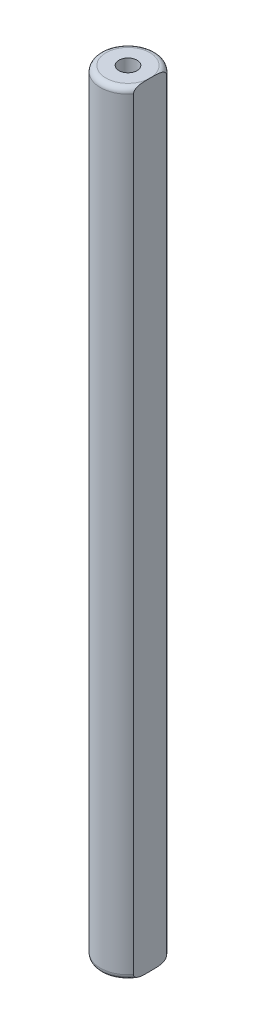
ISO-10303-21;
HEADER;
FILE_DESCRIPTION(('STEP AP214'),'2;1');
FILE_NAME('part.step','',(''),(''),'','','');
FILE_SCHEMA(('AUTOMOTIVE_DESIGN { 1 0 10303 214 1 1 1 1 }'));
ENDSEC;
DATA;
#1=APPLICATION_CONTEXT('core data for automotive mechanical design processes');
#2=APPLICATION_PROTOCOL_DEFINITION('international standard','automotive_design',2000,#1);
#3=PRODUCT_CONTEXT('',#1,'mechanical');
#4=PRODUCT('Part','Part','',(#3));
#5=PRODUCT_RELATED_PRODUCT_CATEGORY('part','',(#4));
#6=PRODUCT_DEFINITION_FORMATION('','',#4);
#7=PRODUCT_DEFINITION_CONTEXT('part definition',#1,'design');
#8=PRODUCT_DEFINITION('design','',#6,#7);
#9=PRODUCT_DEFINITION_SHAPE('','',#8);
#10=(LENGTH_UNIT() NAMED_UNIT(*) SI_UNIT(.MILLI.,.METRE.));
#11=(NAMED_UNIT(*) PLANE_ANGLE_UNIT() SI_UNIT($,.RADIAN.));
#12=(NAMED_UNIT(*) SI_UNIT($,.STERADIAN.) SOLID_ANGLE_UNIT());
#13=UNCERTAINTY_MEASURE_WITH_UNIT(LENGTH_MEASURE(1.E-05),#10,'distance_accuracy_value','');
#14=(GEOMETRIC_REPRESENTATION_CONTEXT(3) GLOBAL_UNCERTAINTY_ASSIGNED_CONTEXT((#13)) GLOBAL_UNIT_ASSIGNED_CONTEXT((#10,
#11,#12)) REPRESENTATION_CONTEXT('',''));
#15=CARTESIAN_POINT('',(0.,0.,0.));
#16=DIRECTION('',(0.,0.,1.));
#17=DIRECTION('',(1.,0.,0.));
#18=AXIS2_PLACEMENT_3D('',#15,#16,#17);
#19=CARTESIAN_POINT('',(0.,-35.15,0.));
#20=DIRECTION('',(0.,-1.,0.));
#21=DIRECTION('',(0.,0.,1.));
#22=AXIS2_PLACEMENT_3D('',#19,#20,#21);
#23=PLANE('',#22);
#24=CARTESIAN_POINT('',(0.,-35.15,0.));
#25=DIRECTION('',(0.,-1.,0.));
#26=DIRECTION('',(0.,0.,-1.));
#27=AXIS2_PLACEMENT_3D('',#24,#25,#26);
#28=CIRCLE('',#27,2.);
#29=CARTESIAN_POINT('',(2.,-35.15,0.));
#30=VERTEX_POINT('',#29);
#31=EDGE_CURVE('E11',#30,#30,#28,.T.);
#32=ORIENTED_EDGE('',*,*,#31,.T.);
#33=EDGE_LOOP('',(#32));
#34=FACE_BOUND('',#33,.T.);
#35=CARTESIAN_POINT('',(0.,-35.15,0.));
#36=DIRECTION('',(0.,1.,0.));
#37=DIRECTION('',(0.,0.,1.));
#38=AXIS2_PLACEMENT_3D('',#35,#36,#37);
#39=CIRCLE('',#38,0.825);
#40=CARTESIAN_POINT('',(0.,-35.15,0.825));
#41=VERTEX_POINT('',#40);
#42=EDGE_CURVE('E136',#41,#41,#39,.T.);
#43=ORIENTED_EDGE('',*,*,#42,.T.);
#44=EDGE_LOOP('',(#43));
#45=FACE_BOUND('',#44,.T.);
#46=ADVANCED_FACE('F32',(#34,#45),#23,.T.);
#47=CARTESIAN_POINT('',(0.,35.15,0.));
#48=DIRECTION('',(0.,-1.,0.));
#49=DIRECTION('',(0.,0.,-1.));
#50=AXIS2_PLACEMENT_3D('',#47,#48,#49);
#51=CYLINDRICAL_SURFACE('',#50,2.5);
#52=DIRECTION('',(0.,1.,0.));
#53=VECTOR('',#52,1.);
#54=CARTESIAN_POINT('',(2.,0.,-1.5));
#55=LINE('',#54,#53);
#56=CARTESIAN_POINT('',(2.,-34.65,-1.5));
#57=VERTEX_POINT('',#56);
#58=CARTESIAN_POINT('',(2.,34.65,-1.5));
#59=VERTEX_POINT('',#58);
#60=EDGE_CURVE('E79',#57,#59,#55,.T.);
#61=ORIENTED_EDGE('',*,*,#60,.F.);
#62=CARTESIAN_POINT('',(0.,-34.65,0.));
#63=DIRECTION('',(0.,-1.,0.));
#64=DIRECTION('',(0.,0.,-1.));
#65=AXIS2_PLACEMENT_3D('',#62,#63,#64);
#66=CIRCLE('',#65,2.5);
#67=CARTESIAN_POINT('',(2.,-34.65,1.5));
#68=VERTEX_POINT('',#67);
#69=EDGE_CURVE('E118',#57,#68,#66,.F.);
#70=ORIENTED_EDGE('',*,*,#69,.T.);
#71=DIRECTION('',(0.,1.,0.));
#72=VECTOR('',#71,1.);
#73=CARTESIAN_POINT('',(2.,0.,1.5));
#74=LINE('',#73,#72);
#75=CARTESIAN_POINT('',(2.,34.65,1.5));
#76=VERTEX_POINT('',#75);
#77=EDGE_CURVE('E124',#68,#76,#74,.T.);
#78=ORIENTED_EDGE('',*,*,#77,.T.);
#79=CARTESIAN_POINT('',(0.,34.65,0.));
#80=DIRECTION('',(0.,1.,0.));
#81=DIRECTION('',(0.,0.,1.));
#82=AXIS2_PLACEMENT_3D('',#79,#80,#81);
#83=CIRCLE('',#82,2.5);
#84=EDGE_CURVE('E74',#76,#59,#83,.F.);
#85=ORIENTED_EDGE('',*,*,#84,.T.);
#86=EDGE_LOOP('',(#61,#70,#78,#85));
#87=FACE_BOUND('',#86,.T.);
#88=ADVANCED_FACE('F155',(#87),#51,.T.);
#89=CARTESIAN_POINT('',(0.,35.15,0.));
#90=DIRECTION('',(0.,1.,0.));
#91=DIRECTION('',(0.,0.,1.));
#92=AXIS2_PLACEMENT_3D('',#89,#90,#91);
#93=PLANE('',#92);
#94=CARTESIAN_POINT('',(0.,35.15,0.));
#95=DIRECTION('',(0.,1.,0.));
#96=DIRECTION('',(0.,0.,1.));
#97=AXIS2_PLACEMENT_3D('',#94,#95,#96);
#98=CIRCLE('',#97,2.);
#99=CARTESIAN_POINT('',(2.,35.15,0.));
#100=VERTEX_POINT('',#99);
#101=EDGE_CURVE('E72',#100,#100,#98,.T.);
#102=ORIENTED_EDGE('',*,*,#101,.T.);
#103=EDGE_LOOP('',(#102));
#104=FACE_BOUND('',#103,.T.);
#105=CARTESIAN_POINT('',(0.,35.15,0.));
#106=DIRECTION('',(0.,1.,0.));
#107=DIRECTION('',(0.,0.,1.));
#108=AXIS2_PLACEMENT_3D('',#105,#106,#107);
#109=CIRCLE('',#108,0.825);
#110=CARTESIAN_POINT('',(0.,35.15,0.825));
#111=VERTEX_POINT('',#110);
#112=EDGE_CURVE('E87',#111,#111,#109,.T.);
#113=ORIENTED_EDGE('',*,*,#112,.F.);
#114=EDGE_LOOP('',(#113));
#115=FACE_BOUND('',#114,.T.);
#116=ADVANCED_FACE('F82',(#104,#115),#93,.T.);
#117=CARTESIAN_POINT('',(0.,30.15,0.));
#118=DIRECTION('',(0.,1.,0.));
#119=DIRECTION('',(0.,0.,1.));
#120=AXIS2_PLACEMENT_3D('',#117,#118,#119);
#121=CYLINDRICAL_SURFACE('',#120,0.825);
#122=CARTESIAN_POINT('',(0.,30.15,0.));
#123=DIRECTION('',(0.,1.,0.));
#124=DIRECTION('',(0.,0.,1.));
#125=AXIS2_PLACEMENT_3D('',#122,#123,#124);
#126=CIRCLE('',#125,0.825);
#127=CARTESIAN_POINT('',(0.,30.15,0.825));
#128=VERTEX_POINT('',#127);
#129=EDGE_CURVE('E84',#128,#128,#126,.T.);
#130=ORIENTED_EDGE('',*,*,#129,.F.);
#131=EDGE_LOOP('',(#130));
#132=FACE_BOUND('',#131,.T.);
#133=ORIENTED_EDGE('',*,*,#112,.T.);
#134=EDGE_LOOP('',(#133));
#135=FACE_BOUND('',#134,.T.);
#136=ADVANCED_FACE('F162',(#132,#135),#121,.F.);
#137=CARTESIAN_POINT('',(0.,30.15,0.));
#138=DIRECTION('',(0.,1.,0.));
#139=DIRECTION('',(0.,0.,1.));
#140=AXIS2_PLACEMENT_3D('',#137,#138,#139);
#141=PLANE('',#140);
#142=ORIENTED_EDGE('',*,*,#129,.T.);
#143=EDGE_LOOP('',(#142));
#144=FACE_BOUND('',#143,.T.);
#145=ADVANCED_FACE('F106',(#144),#141,.T.);
#146=CARTESIAN_POINT('',(2.,0.,-1.5));
#147=DIRECTION('',(-1.,0.,0.));
#148=DIRECTION('',(0.,0.,1.));
#149=AXIS2_PLACEMENT_3D('',#146,#147,#148);
#150=PLANE('',#149);
#151=ORIENTED_EDGE('',*,*,#77,.F.);
#152=CARTESIAN_POINT('',(2.,-34.65,1.5));
#153=CARTESIAN_POINT('',(2.,-34.6700065150284,1.50005508764519));
#154=CARTESIAN_POINT('',(2.,-34.6899505223803,1.49800297503596));
#155=CARTESIAN_POINT('',(2.,-34.7288908622129,1.49017103135305));
#156=CARTESIAN_POINT('',(2.,-34.747894786355,1.48442943896433));
#157=CARTESIAN_POINT('',(2.,-34.7845007170815,1.46971395516311));
#158=CARTESIAN_POINT('',(2.,-34.8021074472319,1.46075157527048));
#159=CARTESIAN_POINT('',(2.,-34.8357418270519,1.44018960181346));
#160=CARTESIAN_POINT('',(2.,-34.8517650844176,1.42858295243752));
#161=CARTESIAN_POINT('',(2.,-34.8889337995344,1.39760924057378));
#162=CARTESIAN_POINT('',(2.,-34.9091275913188,1.37710380043444));
#163=CARTESIAN_POINT('',(2.,-34.9460193785026,1.3332153788633));
#164=CARTESIAN_POINT('',(2.,-34.9627135559447,1.30982929844171));
#165=CARTESIAN_POINT('',(2.,-35.0025266059827,1.24588475655888));
#166=CARTESIAN_POINT('',(2.,-35.0231102761167,1.20375339504331));
#167=CARTESIAN_POINT('',(2.,-35.0492657628372,1.13857481760512));
#168=CARTESIAN_POINT('',(2.,-35.0572271665565,1.11639476146754));
#169=CARTESIAN_POINT('',(2.,-35.0717347834849,1.07158652733004));
#170=CARTESIAN_POINT('',(2.,-35.0782820228324,1.04895868735181));
#171=CARTESIAN_POINT('',(2.,-35.0954775535542,0.982989447767375));
#172=CARTESIAN_POINT('',(2.,-35.1045494991958,0.939240813702868));
#173=CARTESIAN_POINT('',(2.,-35.1194389319571,0.85118057519475));
#174=CARTESIAN_POINT('',(2.,-35.1252529100803,0.806868416119317));
#175=CARTESIAN_POINT('',(2.,-35.1345404183726,0.717748873858497));
#176=CARTESIAN_POINT('',(2.,-35.1380000262617,0.672940110398228));
#177=CARTESIAN_POINT('',(2.,-35.143276064899,0.583224127429996));
#178=CARTESIAN_POINT('',(2.,-35.1450920982067,0.53831688673903));
#179=CARTESIAN_POINT('',(2.,-35.1475884411658,0.45202717013826));
#180=CARTESIAN_POINT('',(2.,-35.148347176557,0.410646661478023));
#181=CARTESIAN_POINT('',(2.,-35.1493649293624,0.327877214900453));
#182=CARTESIAN_POINT('',(2.,-35.1496239046375,0.286488276566584));
#183=CARTESIAN_POINT('',(2.,-35.1499262759538,0.204245986253958));
#184=CARTESIAN_POINT('',(2.,-35.1499724201265,0.163392638975686));
#185=CARTESIAN_POINT('',(2.,-35.1499994454164,0.0816928216893292));
#186=CARTESIAN_POINT('',(2.,-35.1499803376138,0.0408463516913637));
#187=CARTESIAN_POINT('',(2.,-35.15,0.));
#188=B_SPLINE_CURVE_WITH_KNOTS('',3,(#152,#153,#154,#155,#156,#157,#158,#159,#160,#161,#162,
#163,#164,#165,#166,#167,#168,#169,#170,#171,#172,#173,#174,#175,#176,#177,#178,#179,#180,#181,
#182,#183,#184,#185,#186,#187),.UNSPECIFIED.,.F.,.F.,(4,2,2,2,2,2,2,2,2,2,2,2,2,2,2,2,2,4),(0.,
0.0598154823382477,0.119020807803606,0.178016596524454,0.237171689151979,0.323022405322567,
0.408966299732605,0.548800102010772,0.619474466309537,0.690097374684527,0.823948961414437,
0.957944437366601,1.09272554990601,1.22753924580541,1.35169671337948,1.47586464927862,
1.59842472260636,1.72096398530663),.UNSPECIFIED.);
#189=EDGE_CURVE('E41',#68,#30,#188,.T.);
#190=ORIENTED_EDGE('',*,*,#189,.T.);
#191=CARTESIAN_POINT('',(2.,-35.15,0.));
#192=CARTESIAN_POINT('',(2.,-35.149980484284,-0.0407626231076289));
#193=CARTESIAN_POINT('',(2.,-35.1499994433899,-0.0815253750922564));
#194=CARTESIAN_POINT('',(2.,-35.1499726519699,-0.163057529759021));
#195=CARTESIAN_POINT('',(2.,-35.1499268907924,-0.203826932431489));
#196=CARTESIAN_POINT('',(2.,-35.1496272394696,-0.285823216792328));
#197=CARTESIAN_POINT('',(2.,-35.1493710177251,-0.327050094241002));
#198=CARTESIAN_POINT('',(2.,-35.1483653267444,-0.409495794992682));
#199=CARTESIAN_POINT('',(2.,-35.1476158970779,-0.450714618676486));
#200=CARTESIAN_POINT('',(2.,-35.1452076449429,-0.534687159846425));
#201=CARTESIAN_POINT('',(2.,-35.1435155371863,-0.577440036322863));
#202=CARTESIAN_POINT('',(2.,-35.1386762279352,-0.662861842446352));
#203=CARTESIAN_POINT('',(2.,-35.1355293281928,-0.705530787660099));
#204=CARTESIAN_POINT('',(2.,-35.1271629448661,-0.790467964812873));
#205=CARTESIAN_POINT('',(2.,-35.1219534285849,-0.832737137282493));
#206=CARTESIAN_POINT('',(2.,-35.1087065375739,-0.916821134882455));
#207=CARTESIAN_POINT('',(2.,-35.1006717348777,-0.958636337716518));
#208=CARTESIAN_POINT('',(2.,-35.0868499282799,-1.01633423815903));
#209=CARTESIAN_POINT('',(2.,-35.0826447414506,-1.0325980627166));
#210=CARTESIAN_POINT('',(2.,-35.0735803939948,-1.06494846149724));
#211=CARTESIAN_POINT('',(2.,-35.0687209867408,-1.08103496638818));
#212=CARTESIAN_POINT('',(2.,-35.0530766101654,-1.12889043811801));
#213=CARTESIAN_POINT('',(2.,-35.0412104355907,-1.16032087149606));
#214=CARTESIAN_POINT('',(2.,-35.0138471087185,-1.22193787642586));
#215=CARTESIAN_POINT('',(2.,-34.9983172442343,-1.25211017751241));
#216=CARTESIAN_POINT('',(2.,-34.9629711649222,-1.30987180248264));
#217=CARTESIAN_POINT('',(2.,-34.9431618343013,-1.33746517402654));
#218=CARTESIAN_POINT('',(2.,-34.9063229296638,-1.37963467843693));
#219=CARTESIAN_POINT('',(2.,-34.890685118637,-1.39542133682361));
#220=CARTESIAN_POINT('',(2.,-34.8572261082969,-1.4245077100884));
#221=CARTESIAN_POINT('',(2.,-34.8394069701865,-1.43780974319198));
#222=CARTESIAN_POINT('',(2.,-34.8045634610992,-1.45935751669131));
#223=CARTESIAN_POINT('',(2.,-34.787825568107,-1.46806350146973));
#224=CARTESIAN_POINT('',(2.,-34.7531430315798,-1.48256312102217));
#225=CARTESIAN_POINT('',(2.,-34.7352009877708,-1.48836281472543));
#226=CARTESIAN_POINT('',(2.,-34.7059337018007,-1.49497096281988));
#227=CARTESIAN_POINT('',(2.,-34.6948421897842,-1.49684839330713));
#228=CARTESIAN_POINT('',(2.,-34.6725033908703,-1.49936626406293));
#229=CARTESIAN_POINT('',(2.,-34.6612558958349,-1.5000048503837));
#230=CARTESIAN_POINT('',(2.,-34.65,-1.5));
#231=B_SPLINE_CURVE_WITH_KNOTS('',3,(#191,#192,#193,#194,#195,#196,#197,#198,#199,#200,#201,
#202,#203,#204,#205,#206,#207,#208,#209,#210,#211,#212,#213,#214,#215,#216,#217,#218,#219,#220,
#221,#222,#223,#224,#225,#226,#227,#228,#229,#230),.UNSPECIFIED.,.F.,.F.,(4,2,2,2,2,2,2,2,2,2,2,
2,2,2,2,2,2,2,2,4),(0.,0.122288098502134,0.244596325308749,0.368278121933788,0.491949996900832,
0.620293921253729,0.74861123651507,0.876315899810972,1.00390460532892,1.05428854590096,
1.10469153363842,1.20529649885782,1.30683621704435,1.40821379274341,1.47468160162245,
1.54108708094666,1.5974625296124,1.65371995469663,1.68740390926937,1.72113823358774),.UNSPECIFIED.);
#232=EDGE_CURVE('E51',#30,#57,#231,.T.);
#233=ORIENTED_EDGE('',*,*,#232,.T.);
#234=ORIENTED_EDGE('',*,*,#60,.T.);
#235=CARTESIAN_POINT('',(2.,34.65,-1.5));
#236=CARTESIAN_POINT('',(2.,34.6700065150284,-1.50005508764519));
#237=CARTESIAN_POINT('',(2.,34.6899505223803,-1.49800297503596));
#238=CARTESIAN_POINT('',(2.,34.7288908622129,-1.49017103135305));
#239=CARTESIAN_POINT('',(2.,34.747894786355,-1.48442943896433));
#240=CARTESIAN_POINT('',(2.,34.7845007170815,-1.46971395516311));
#241=CARTESIAN_POINT('',(2.,34.8021074472319,-1.46075157527048));
#242=CARTESIAN_POINT('',(2.,34.8357418270519,-1.44018960181346));
#243=CARTESIAN_POINT('',(2.,34.8517650844176,-1.42858295243752));
#244=CARTESIAN_POINT('',(2.,34.8889337995344,-1.39760924057378));
#245=CARTESIAN_POINT('',(2.,34.9091275913188,-1.37710380043444));
#246=CARTESIAN_POINT('',(2.,34.9460193785026,-1.3332153788633));
#247=CARTESIAN_POINT('',(2.,34.9627135559447,-1.30982929844171));
#248=CARTESIAN_POINT('',(2.,35.0025266059827,-1.24588475655888));
#249=CARTESIAN_POINT('',(2.,35.0231102761167,-1.20375339504331));
#250=CARTESIAN_POINT('',(2.,35.0492657628372,-1.13857481760512));
#251=CARTESIAN_POINT('',(2.,35.0572271665565,-1.11639476146754));
#252=CARTESIAN_POINT('',(2.,35.0717347834849,-1.07158652733004));
#253=CARTESIAN_POINT('',(2.,35.0782820228324,-1.04895868735181));
#254=CARTESIAN_POINT('',(2.,35.0954775535542,-0.982989447767375));
#255=CARTESIAN_POINT('',(2.,35.1045494991958,-0.939240813702868));
#256=CARTESIAN_POINT('',(2.,35.1194389319571,-0.85118057519475));
#257=CARTESIAN_POINT('',(2.,35.1252529100803,-0.806868416119317));
#258=CARTESIAN_POINT('',(2.,35.1345404183726,-0.717748873858497));
#259=CARTESIAN_POINT('',(2.,35.1380000262617,-0.672940110398228));
#260=CARTESIAN_POINT('',(2.,35.143276064899,-0.583224127429996));
#261=CARTESIAN_POINT('',(2.,35.1450920982067,-0.53831688673903));
#262=CARTESIAN_POINT('',(2.,35.1475884411658,-0.45202717013826));
#263=CARTESIAN_POINT('',(2.,35.148347176557,-0.410646661478023));
#264=CARTESIAN_POINT('',(2.,35.1493649293624,-0.327877214900453));
#265=CARTESIAN_POINT('',(2.,35.1496239046375,-0.286488276566584));
#266=CARTESIAN_POINT('',(2.,35.1499262759538,-0.204245986253958));
#267=CARTESIAN_POINT('',(2.,35.1499724201265,-0.163392638975686));
#268=CARTESIAN_POINT('',(2.,35.1499994454164,-0.0816928216893292));
#269=CARTESIAN_POINT('',(2.,35.1499803376138,-0.0408463516913637));
#270=CARTESIAN_POINT('',(2.,35.15,0.));
#271=B_SPLINE_CURVE_WITH_KNOTS('',3,(#235,#236,#237,#238,#239,#240,#241,#242,#243,#244,#245,
#246,#247,#248,#249,#250,#251,#252,#253,#254,#255,#256,#257,#258,#259,#260,#261,#262,#263,#264,
#265,#266,#267,#268,#269,#270),.UNSPECIFIED.,.F.,.F.,(4,2,2,2,2,2,2,2,2,2,2,2,2,2,2,2,2,4),(0.,
0.0598154823382477,0.119020807803606,0.178016596524454,0.237171689151979,0.323022405322567,
0.408966299732605,0.548800102010772,0.619474466309537,0.690097374684527,0.823948961414437,
0.957944437366601,1.09272554990601,1.22753924580541,1.35169671337948,1.47586464927862,
1.59842472260636,1.72096398530663),.UNSPECIFIED.);
#272=EDGE_CURVE('E76',#59,#100,#271,.T.);
#273=ORIENTED_EDGE('',*,*,#272,.T.);
#274=CARTESIAN_POINT('',(2.,35.15,0.));
#275=CARTESIAN_POINT('',(2.,35.149980484284,0.0407626231076289));
#276=CARTESIAN_POINT('',(2.,35.1499994433899,0.0815253750922564));
#277=CARTESIAN_POINT('',(2.,35.1499726519699,0.163057529759021));
#278=CARTESIAN_POINT('',(2.,35.1499268907924,0.203826932431489));
#279=CARTESIAN_POINT('',(2.,35.1496272394696,0.285823216792328));
#280=CARTESIAN_POINT('',(2.,35.1493710177251,0.327050094241002));
#281=CARTESIAN_POINT('',(2.,35.1483653267444,0.409495794992682));
#282=CARTESIAN_POINT('',(2.,35.1476158970779,0.450714618676486));
#283=CARTESIAN_POINT('',(2.,35.1452076449429,0.534687159846425));
#284=CARTESIAN_POINT('',(2.,35.1435155371863,0.577440036322863));
#285=CARTESIAN_POINT('',(2.,35.1386762279352,0.662861842446352));
#286=CARTESIAN_POINT('',(2.,35.1355293281928,0.705530787660099));
#287=CARTESIAN_POINT('',(2.,35.1271629448661,0.790467964812873));
#288=CARTESIAN_POINT('',(2.,35.1219534285849,0.832737137282493));
#289=CARTESIAN_POINT('',(2.,35.1087065375739,0.916821134882455));
#290=CARTESIAN_POINT('',(2.,35.1006717348777,0.958636337716518));
#291=CARTESIAN_POINT('',(2.,35.0868499282799,1.01633423815903));
#292=CARTESIAN_POINT('',(2.,35.0826447414506,1.0325980627166));
#293=CARTESIAN_POINT('',(2.,35.0735803939948,1.06494846149724));
#294=CARTESIAN_POINT('',(2.,35.0687209867408,1.08103496638818));
#295=CARTESIAN_POINT('',(2.,35.0530766101654,1.12889043811801));
#296=CARTESIAN_POINT('',(2.,35.0412104355907,1.16032087149606));
#297=CARTESIAN_POINT('',(2.,35.0138471087185,1.22193787642586));
#298=CARTESIAN_POINT('',(2.,34.9983172442343,1.25211017751241));
#299=CARTESIAN_POINT('',(2.,34.9629711649222,1.30987180248264));
#300=CARTESIAN_POINT('',(2.,34.9431618343013,1.33746517402654));
#301=CARTESIAN_POINT('',(2.,34.9063229296638,1.37963467843693));
#302=CARTESIAN_POINT('',(2.,34.890685118637,1.39542133682361));
#303=CARTESIAN_POINT('',(2.,34.8572261082969,1.4245077100884));
#304=CARTESIAN_POINT('',(2.,34.8394069701865,1.43780974319198));
#305=CARTESIAN_POINT('',(2.,34.8045634610992,1.45935751669131));
#306=CARTESIAN_POINT('',(2.,34.787825568107,1.46806350146973));
#307=CARTESIAN_POINT('',(2.,34.7531430315798,1.48256312102217));
#308=CARTESIAN_POINT('',(2.,34.7352009877708,1.48836281472543));
#309=CARTESIAN_POINT('',(2.,34.7059337018007,1.49497096281988));
#310=CARTESIAN_POINT('',(2.,34.6948421897842,1.49684839330713));
#311=CARTESIAN_POINT('',(2.,34.6725033908703,1.49936626406293));
#312=CARTESIAN_POINT('',(2.,34.6612558958349,1.5000048503837));
#313=CARTESIAN_POINT('',(2.,34.65,1.5));
#314=B_SPLINE_CURVE_WITH_KNOTS('',3,(#274,#275,#276,#277,#278,#279,#280,#281,#282,#283,#284,
#285,#286,#287,#288,#289,#290,#291,#292,#293,#294,#295,#296,#297,#298,#299,#300,#301,#302,#303,
#304,#305,#306,#307,#308,#309,#310,#311,#312,#313),.UNSPECIFIED.,.F.,.F.,(4,2,2,2,2,2,2,2,2,2,2,
2,2,2,2,2,2,2,2,4),(0.,0.122288098502134,0.244596325308749,0.368278121933788,0.491949996900832,
0.620293921253729,0.74861123651507,0.876315899810972,1.00390460532892,1.05428854590096,
1.10469153363842,1.20529649885782,1.30683621704435,1.40821379274341,1.47468160162245,
1.54108708094666,1.5974625296124,1.65371995469663,1.68740390926937,1.72113823358774),.UNSPECIFIED.);
#315=EDGE_CURVE('E67',#100,#76,#314,.T.);
#316=ORIENTED_EDGE('',*,*,#315,.T.);
#317=EDGE_LOOP('',(#151,#190,#233,#234,#273,#316));
#318=FACE_BOUND('',#317,.T.);
#319=ADVANCED_FACE('F78',(#318),#150,.F.);
#320=CARTESIAN_POINT('',(0.,34.65,0.));
#321=DIRECTION('',(0.,1.,0.));
#322=DIRECTION('',(0.,0.,1.));
#323=AXIS2_PLACEMENT_3D('',#320,#321,#322);
#324=TOROIDAL_SURFACE('',#323,2.,0.5);
#325=ORIENTED_EDGE('',*,*,#272,.F.);
#326=ORIENTED_EDGE('',*,*,#84,.F.);
#327=ORIENTED_EDGE('',*,*,#315,.F.);
#328=ORIENTED_EDGE('',*,*,#101,.F.);
#329=EDGE_LOOP('',(#325,#326,#327,#328));
#330=FACE_BOUND('',#329,.T.);
#331=ADVANCED_FACE('F70',(#330),#324,.T.);
#332=CARTESIAN_POINT('',(0.,-30.15,0.));
#333=DIRECTION('',(0.,-1.,0.));
#334=DIRECTION('',(0.,0.,-1.));
#335=AXIS2_PLACEMENT_3D('',#332,#333,#334);
#336=CYLINDRICAL_SURFACE('',#335,0.825);
#337=CARTESIAN_POINT('',(0.,-30.15,0.));
#338=DIRECTION('',(0.,1.,0.));
#339=DIRECTION('',(0.,0.,1.));
#340=AXIS2_PLACEMENT_3D('',#337,#338,#339);
#341=CIRCLE('',#340,0.825);
#342=CARTESIAN_POINT('',(0.,-30.15,0.825));
#343=VERTEX_POINT('',#342);
#344=EDGE_CURVE('E134',#343,#343,#341,.T.);
#345=ORIENTED_EDGE('',*,*,#344,.T.);
#346=EDGE_LOOP('',(#345));
#347=FACE_BOUND('',#346,.T.);
#348=ORIENTED_EDGE('',*,*,#42,.F.);
#349=EDGE_LOOP('',(#348));
#350=FACE_BOUND('',#349,.T.);
#351=ADVANCED_FACE('F145',(#347,#350),#336,.F.);
#352=CARTESIAN_POINT('',(0.,-30.15,0.));
#353=DIRECTION('',(0.,-1.,0.));
#354=DIRECTION('',(0.,0.,1.));
#355=AXIS2_PLACEMENT_3D('',#352,#353,#354);
#356=PLANE('',#355);
#357=ORIENTED_EDGE('',*,*,#344,.F.);
#358=EDGE_LOOP('',(#357));
#359=FACE_BOUND('',#358,.T.);
#360=ADVANCED_FACE('F147',(#359),#356,.T.);
#361=CARTESIAN_POINT('',(0.,-34.65,0.));
#362=DIRECTION('',(0.,-1.,0.));
#363=DIRECTION('',(0.,0.,-1.));
#364=AXIS2_PLACEMENT_3D('',#361,#362,#363);
#365=TOROIDAL_SURFACE('',#364,2.,0.5);
#366=ORIENTED_EDGE('',*,*,#232,.F.);
#367=ORIENTED_EDGE('',*,*,#31,.F.);
#368=ORIENTED_EDGE('',*,*,#189,.F.);
#369=ORIENTED_EDGE('',*,*,#69,.F.);
#370=EDGE_LOOP('',(#366,#367,#368,#369));
#371=FACE_BOUND('',#370,.T.);
#372=ADVANCED_FACE('F34',(#371),#365,.T.);
#373=CLOSED_SHELL('',(#46,#88,#116,#136,#145,#319,#331,#351,#360,#372));
#374=MANIFOLD_SOLID_BREP('B2',#373);
#375=ADVANCED_BREP_SHAPE_REPRESENTATION('',(#18,#374),#14);
#376=SHAPE_DEFINITION_REPRESENTATION(#9,#375);
ENDSEC;
END-ISO-10303-21;
